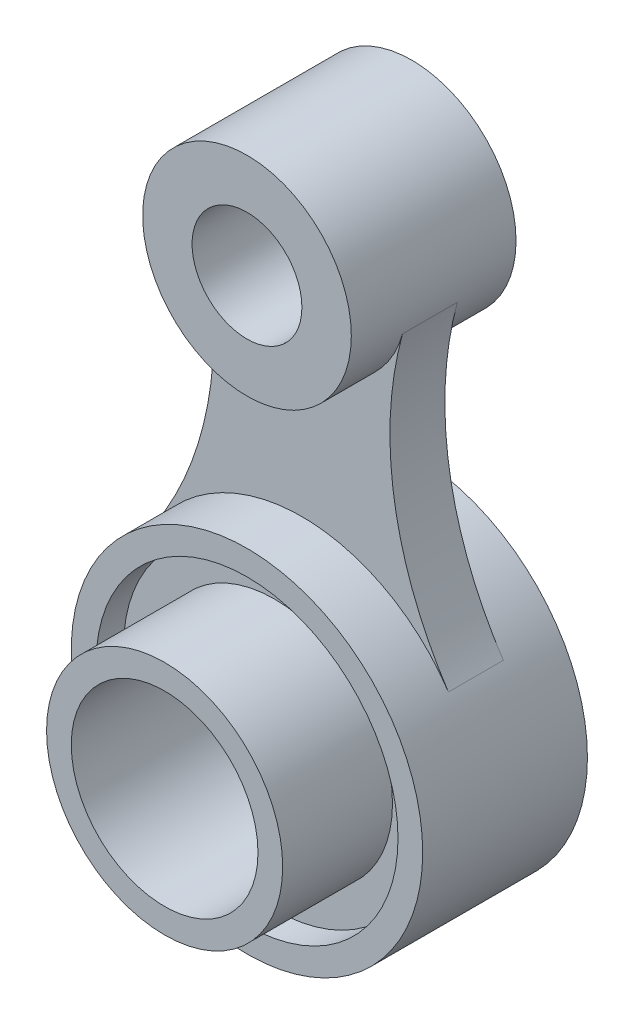
ISO-10303-21;
HEADER;
FILE_DESCRIPTION(('STEP AP214'),'2;1');
FILE_NAME('part.step','',(''),(''),'','','');
FILE_SCHEMA(('AUTOMOTIVE_DESIGN { 1 0 10303 214 1 1 1 1 }'));
ENDSEC;
DATA;
#1=APPLICATION_CONTEXT('core data for automotive mechanical design processes');
#2=APPLICATION_PROTOCOL_DEFINITION('international standard','automotive_design',2000,#1);
#3=PRODUCT_CONTEXT('',#1,'mechanical');
#4=PRODUCT('Part','Part','',(#3));
#5=PRODUCT_RELATED_PRODUCT_CATEGORY('part','',(#4));
#6=PRODUCT_DEFINITION_FORMATION('','',#4);
#7=PRODUCT_DEFINITION_CONTEXT('part definition',#1,'design');
#8=PRODUCT_DEFINITION('design','',#6,#7);
#9=PRODUCT_DEFINITION_SHAPE('','',#8);
#10=(LENGTH_UNIT() NAMED_UNIT(*) SI_UNIT(.MILLI.,.METRE.));
#11=(NAMED_UNIT(*) PLANE_ANGLE_UNIT() SI_UNIT($,.RADIAN.));
#12=(NAMED_UNIT(*) SI_UNIT($,.STERADIAN.) SOLID_ANGLE_UNIT());
#13=UNCERTAINTY_MEASURE_WITH_UNIT(LENGTH_MEASURE(1.E-05),#10,'distance_accuracy_value','');
#14=(GEOMETRIC_REPRESENTATION_CONTEXT(3) GLOBAL_UNCERTAINTY_ASSIGNED_CONTEXT((#13)) GLOBAL_UNIT_ASSIGNED_CONTEXT((#10,
#11,#12)) REPRESENTATION_CONTEXT('',''));
#15=CARTESIAN_POINT('',(0.,0.,0.));
#16=DIRECTION('',(0.,0.,1.));
#17=DIRECTION('',(1.,0.,0.));
#18=AXIS2_PLACEMENT_3D('',#15,#16,#17);
#19=CARTESIAN_POINT('',(0.,75.,30.));
#20=DIRECTION('',(0.,0.,-1.));
#21=DIRECTION('',(-1.,0.,0.));
#22=AXIS2_PLACEMENT_3D('',#19,#20,#21);
#23=CYLINDRICAL_SURFACE('',#22,19.);
#24=DIRECTION('',(0.,0.,-1.));
#25=VECTOR('',#24,1.);
#26=CARTESIAN_POINT('',(-18.3212439861572,69.9669076305221,20.));
#27=LINE('',#26,#25);
#28=CARTESIAN_POINT('',(-18.3212439861572,69.9669076305221,20.));
#29=VERTEX_POINT('',#28);
#30=CARTESIAN_POINT('',(-18.3212439861572,69.9669076305221,10.));
#31=VERTEX_POINT('',#30);
#32=EDGE_CURVE('E57',#29,#31,#27,.T.);
#33=ORIENTED_EDGE('',*,*,#32,.F.);
#34=CARTESIAN_POINT('',(0.,75.,20.));
#35=DIRECTION('',(0.,0.,1.));
#36=DIRECTION('',(1.,0.,0.));
#37=AXIS2_PLACEMENT_3D('',#34,#35,#36);
#38=CIRCLE('',#37,19.);
#39=CARTESIAN_POINT('',(18.3212439861573,69.9669076305221,20.));
#40=VERTEX_POINT('',#39);
#41=EDGE_CURVE('E62',#29,#40,#38,.T.);
#42=ORIENTED_EDGE('',*,*,#41,.T.);
#43=DIRECTION('',(0.,0.,-1.));
#44=VECTOR('',#43,1.);
#45=CARTESIAN_POINT('',(18.3212439861572,69.9669076305221,20.));
#46=LINE('',#45,#44);
#47=CARTESIAN_POINT('',(18.3212439861572,69.9669076305221,10.));
#48=VERTEX_POINT('',#47);
#49=EDGE_CURVE('E102',#40,#48,#46,.T.);
#50=ORIENTED_EDGE('',*,*,#49,.T.);
#51=CARTESIAN_POINT('',(0.,75.,10.));
#52=DIRECTION('',(0.,0.,1.));
#53=DIRECTION('',(1.,0.,0.));
#54=AXIS2_PLACEMENT_3D('',#51,#52,#53);
#55=CIRCLE('',#54,19.);
#56=EDGE_CURVE('E106',#31,#48,#55,.T.);
#57=ORIENTED_EDGE('',*,*,#56,.F.);
#58=EDGE_LOOP('',(#33,#42,#50,#57));
#59=FACE_BOUND('',#58,.T.);
#60=CARTESIAN_POINT('',(0.,75.,30.));
#61=DIRECTION('',(0.,0.,1.));
#62=DIRECTION('',(1.,0.,0.));
#63=AXIS2_PLACEMENT_3D('',#60,#61,#62);
#64=CIRCLE('',#63,19.);
#65=CARTESIAN_POINT('',(19.,75.,30.));
#66=VERTEX_POINT('',#65);
#67=EDGE_CURVE('E49',#66,#66,#64,.T.);
#68=ORIENTED_EDGE('',*,*,#67,.F.);
#69=EDGE_LOOP('',(#68));
#70=FACE_BOUND('',#69,.T.);
#71=CARTESIAN_POINT('',(0.,75.,0.));
#72=DIRECTION('',(0.,0.,1.));
#73=DIRECTION('',(1.,0.,0.));
#74=AXIS2_PLACEMENT_3D('',#71,#72,#73);
#75=CIRCLE('',#74,19.);
#76=CARTESIAN_POINT('',(19.,75.,0.));
#77=VERTEX_POINT('',#76);
#78=EDGE_CURVE('E115',#77,#77,#75,.T.);
#79=ORIENTED_EDGE('',*,*,#78,.T.);
#80=EDGE_LOOP('',(#79));
#81=FACE_BOUND('',#80,.T.);
#82=ADVANCED_FACE('F41',(#59,#70,#81),#23,.T.);
#83=CARTESIAN_POINT('',(0.,75.,30.));
#84=DIRECTION('',(0.,0.,-1.));
#85=DIRECTION('',(-1.,0.,0.));
#86=AXIS2_PLACEMENT_3D('',#83,#84,#85);
#87=CYLINDRICAL_SURFACE('',#86,10.);
#88=CARTESIAN_POINT('',(0.,75.,30.));
#89=DIRECTION('',(0.,0.,1.));
#90=DIRECTION('',(1.,0.,0.));
#91=AXIS2_PLACEMENT_3D('',#88,#89,#90);
#92=CIRCLE('',#91,10.);
#93=CARTESIAN_POINT('',(10.,75.,30.));
#94=VERTEX_POINT('',#93);
#95=EDGE_CURVE('E11',#94,#94,#92,.T.);
#96=ORIENTED_EDGE('',*,*,#95,.T.);
#97=EDGE_LOOP('',(#96));
#98=FACE_BOUND('',#97,.T.);
#99=CARTESIAN_POINT('',(0.,75.,0.));
#100=DIRECTION('',(0.,0.,1.));
#101=DIRECTION('',(1.,0.,0.));
#102=AXIS2_PLACEMENT_3D('',#99,#100,#101);
#103=CIRCLE('',#102,10.);
#104=CARTESIAN_POINT('',(10.,75.,0.));
#105=VERTEX_POINT('',#104);
#106=EDGE_CURVE('E44',#105,#105,#103,.T.);
#107=ORIENTED_EDGE('',*,*,#106,.F.);
#108=EDGE_LOOP('',(#107));
#109=FACE_BOUND('',#108,.T.);
#110=ADVANCED_FACE('F125',(#98,#109),#87,.F.);
#111=CARTESIAN_POINT('',(0.,0.,30.));
#112=DIRECTION('',(0.,0.,1.));
#113=DIRECTION('',(1.,0.,0.));
#114=AXIS2_PLACEMENT_3D('',#111,#112,#113);
#115=PLANE('',#114);
#116=ORIENTED_EDGE('',*,*,#67,.T.);
#117=EDGE_LOOP('',(#116));
#118=FACE_BOUND('',#117,.T.);
#119=ORIENTED_EDGE('',*,*,#95,.F.);
#120=EDGE_LOOP('',(#119));
#121=FACE_BOUND('',#120,.T.);
#122=ADVANCED_FACE('F127',(#118,#121),#115,.T.);
#123=CARTESIAN_POINT('',(0.,0.,0.));
#124=DIRECTION('',(0.,0.,1.));
#125=DIRECTION('',(1.,0.,0.));
#126=AXIS2_PLACEMENT_3D('',#123,#124,#125);
#127=PLANE('',#126);
#128=ORIENTED_EDGE('',*,*,#78,.F.);
#129=EDGE_LOOP('',(#128));
#130=FACE_BOUND('',#129,.T.);
#131=ORIENTED_EDGE('',*,*,#106,.T.);
#132=EDGE_LOOP('',(#131));
#133=FACE_BOUND('',#132,.T.);
#134=ADVANCED_FACE('F123',(#130,#133),#127,.F.);
#135=CARTESIAN_POINT('',(-80.034907939529,53.0133333333333,20.));
#136=DIRECTION('',(0.,0.,-1.));
#137=DIRECTION('',(-1.,0.,0.));
#138=AXIS2_PLACEMENT_3D('',#135,#136,#137);
#139=CYLINDRICAL_SURFACE('',#138,64.);
#140=CARTESIAN_POINT('',(-80.034907939529,53.0133333333333,10.));
#141=DIRECTION('',(0.,0.,1.));
#142=DIRECTION('',(1.,0.,0.));
#143=AXIS2_PLACEMENT_3D('',#140,#141,#142);
#144=CIRCLE('',#143,64.);
#145=CARTESIAN_POINT('',(-26.6783026465097,17.6711111111111,10.));
#146=VERTEX_POINT('',#145);
#147=EDGE_CURVE('E94',#31,#146,#144,.F.);
#148=ORIENTED_EDGE('',*,*,#147,.T.);
#149=DIRECTION('',(0.,0.,-1.));
#150=VECTOR('',#149,1.);
#151=CARTESIAN_POINT('',(-26.6783026465097,17.6711111111111,20.));
#152=LINE('',#151,#150);
#153=CARTESIAN_POINT('',(-26.6783026465097,17.6711111111111,20.));
#154=VERTEX_POINT('',#153);
#155=EDGE_CURVE('E88',#154,#146,#152,.T.);
#156=ORIENTED_EDGE('',*,*,#155,.F.);
#157=CARTESIAN_POINT('',(-80.034907939529,53.0133333333333,20.));
#158=DIRECTION('',(0.,0.,1.));
#159=DIRECTION('',(1.,0.,0.));
#160=AXIS2_PLACEMENT_3D('',#157,#158,#159);
#161=CIRCLE('',#160,64.);
#162=EDGE_CURVE('E108',#29,#154,#161,.F.);
#163=ORIENTED_EDGE('',*,*,#162,.F.);
#164=ORIENTED_EDGE('',*,*,#32,.T.);
#165=EDGE_LOOP('',(#148,#156,#163,#164));
#166=FACE_BOUND('',#165,.T.);
#167=ADVANCED_FACE('F137',(#166),#139,.F.);
#168=CARTESIAN_POINT('',(80.034907939529,53.0133333333333,20.));
#169=DIRECTION('',(0.,0.,-1.));
#170=DIRECTION('',(-1.,0.,0.));
#171=AXIS2_PLACEMENT_3D('',#168,#169,#170);
#172=CYLINDRICAL_SURFACE('',#171,64.);
#173=CARTESIAN_POINT('',(80.034907939529,53.0133333333333,10.));
#174=DIRECTION('',(0.,0.,1.));
#175=DIRECTION('',(1.,0.,0.));
#176=AXIS2_PLACEMENT_3D('',#173,#174,#175);
#177=CIRCLE('',#176,64.);
#178=CARTESIAN_POINT('',(26.6783026465097,17.6711111111111,10.));
#179=VERTEX_POINT('',#178);
#180=EDGE_CURVE('E93',#48,#179,#177,.T.);
#181=ORIENTED_EDGE('',*,*,#180,.F.);
#182=ORIENTED_EDGE('',*,*,#49,.F.);
#183=CARTESIAN_POINT('',(80.034907939529,53.0133333333333,20.));
#184=DIRECTION('',(0.,0.,1.));
#185=DIRECTION('',(1.,0.,0.));
#186=AXIS2_PLACEMENT_3D('',#183,#184,#185);
#187=CIRCLE('',#186,64.);
#188=CARTESIAN_POINT('',(26.6783026465097,17.6711111111111,20.));
#189=VERTEX_POINT('',#188);
#190=EDGE_CURVE('E101',#40,#189,#187,.T.);
#191=ORIENTED_EDGE('',*,*,#190,.T.);
#192=DIRECTION('',(0.,0.,-1.));
#193=VECTOR('',#192,1.);
#194=CARTESIAN_POINT('',(26.6783026465097,17.6711111111111,20.));
#195=LINE('',#194,#193);
#196=EDGE_CURVE('E85',#189,#179,#195,.T.);
#197=ORIENTED_EDGE('',*,*,#196,.T.);
#198=EDGE_LOOP('',(#181,#182,#191,#197));
#199=FACE_BOUND('',#198,.T.);
#200=ADVANCED_FACE('F99',(#199),#172,.F.);
#201=CARTESIAN_POINT('',(0.,0.,20.));
#202=DIRECTION('',(0.,0.,1.));
#203=DIRECTION('',(1.,0.,0.));
#204=AXIS2_PLACEMENT_3D('',#201,#202,#203);
#205=PLANE('',#204);
#206=ORIENTED_EDGE('',*,*,#41,.F.);
#207=ORIENTED_EDGE('',*,*,#162,.T.);
#208=CARTESIAN_POINT('',(0.,0.,20.));
#209=DIRECTION('',(0.,0.,1.));
#210=DIRECTION('',(1.,0.,0.));
#211=AXIS2_PLACEMENT_3D('',#208,#209,#210);
#212=CIRCLE('',#211,32.);
#213=EDGE_CURVE('E213',#189,#154,#212,.T.);
#214=ORIENTED_EDGE('',*,*,#213,.F.);
#215=ORIENTED_EDGE('',*,*,#190,.F.);
#216=EDGE_LOOP('',(#206,#207,#214,#215));
#217=FACE_BOUND('',#216,.T.);
#218=ADVANCED_FACE('F145',(#217),#205,.T.);
#219=CARTESIAN_POINT('',(0.,0.,10.));
#220=DIRECTION('',(0.,0.,1.));
#221=DIRECTION('',(1.,0.,0.));
#222=AXIS2_PLACEMENT_3D('',#219,#220,#221);
#223=PLANE('',#222);
#224=ORIENTED_EDGE('',*,*,#56,.T.);
#225=ORIENTED_EDGE('',*,*,#180,.T.);
#226=CARTESIAN_POINT('',(0.,0.,10.));
#227=DIRECTION('',(0.,0.,1.));
#228=DIRECTION('',(1.,0.,0.));
#229=AXIS2_PLACEMENT_3D('',#226,#227,#228);
#230=CIRCLE('',#229,32.);
#231=EDGE_CURVE('E81',#179,#146,#230,.T.);
#232=ORIENTED_EDGE('',*,*,#231,.T.);
#233=ORIENTED_EDGE('',*,*,#147,.F.);
#234=EDGE_LOOP('',(#224,#225,#232,#233));
#235=FACE_BOUND('',#234,.T.);
#236=ADVANCED_FACE('F105',(#235),#223,.F.);
#237=CARTESIAN_POINT('',(0.,0.,30.));
#238=DIRECTION('',(0.,0.,-1.));
#239=DIRECTION('',(-1.,0.,0.));
#240=AXIS2_PLACEMENT_3D('',#237,#238,#239);
#241=CYLINDRICAL_SURFACE('',#240,27.5);
#242=CARTESIAN_POINT('',(0.,0.,25.));
#243=DIRECTION('',(0.,0.,1.));
#244=DIRECTION('',(1.,0.,0.));
#245=AXIS2_PLACEMENT_3D('',#242,#243,#244);
#246=CIRCLE('',#245,27.5);
#247=CARTESIAN_POINT('',(27.5,0.,25.));
#248=VERTEX_POINT('',#247);
#249=EDGE_CURVE('E206',#248,#248,#246,.T.);
#250=ORIENTED_EDGE('',*,*,#249,.F.);
#251=EDGE_LOOP('',(#250));
#252=FACE_BOUND('',#251,.T.);
#253=CARTESIAN_POINT('',(0.,0.,30.));
#254=DIRECTION('',(0.,0.,1.));
#255=DIRECTION('',(1.,0.,0.));
#256=AXIS2_PLACEMENT_3D('',#253,#254,#255);
#257=CIRCLE('',#256,27.5);
#258=CARTESIAN_POINT('',(27.5,0.,30.));
#259=VERTEX_POINT('',#258);
#260=EDGE_CURVE('E200',#259,#259,#257,.T.);
#261=ORIENTED_EDGE('',*,*,#260,.T.);
#262=EDGE_LOOP('',(#261));
#263=FACE_BOUND('',#262,.T.);
#264=ADVANCED_FACE('F148',(#252,#263),#241,.F.);
#265=CARTESIAN_POINT('',(0.,0.,30.));
#266=DIRECTION('',(0.,0.,-1.));
#267=DIRECTION('',(-1.,0.,0.));
#268=AXIS2_PLACEMENT_3D('',#265,#266,#267);
#269=CYLINDRICAL_SURFACE('',#268,32.);
#270=ORIENTED_EDGE('',*,*,#213,.T.);
#271=ORIENTED_EDGE('',*,*,#155,.T.);
#272=ORIENTED_EDGE('',*,*,#231,.F.);
#273=ORIENTED_EDGE('',*,*,#196,.F.);
#274=EDGE_LOOP('',(#270,#271,#272,#273));
#275=FACE_BOUND('',#274,.T.);
#276=CARTESIAN_POINT('',(0.,0.,30.));
#277=DIRECTION('',(0.,0.,1.));
#278=DIRECTION('',(1.,0.,0.));
#279=AXIS2_PLACEMENT_3D('',#276,#277,#278);
#280=CIRCLE('',#279,32.);
#281=CARTESIAN_POINT('',(32.,0.,30.));
#282=VERTEX_POINT('',#281);
#283=EDGE_CURVE('E203',#282,#282,#280,.T.);
#284=ORIENTED_EDGE('',*,*,#283,.F.);
#285=EDGE_LOOP('',(#284));
#286=FACE_BOUND('',#285,.T.);
#287=CARTESIAN_POINT('',(0.,0.,0.));
#288=DIRECTION('',(0.,0.,1.));
#289=DIRECTION('',(1.,0.,0.));
#290=AXIS2_PLACEMENT_3D('',#287,#288,#289);
#291=CIRCLE('',#290,32.);
#292=CARTESIAN_POINT('',(32.,0.,0.));
#293=VERTEX_POINT('',#292);
#294=EDGE_CURVE('E193',#293,#293,#291,.T.);
#295=ORIENTED_EDGE('',*,*,#294,.T.);
#296=EDGE_LOOP('',(#295));
#297=FACE_BOUND('',#296,.T.);
#298=ADVANCED_FACE('F83',(#275,#286,#297),#269,.T.);
#299=CARTESIAN_POINT('',(0.,0.,30.));
#300=DIRECTION('',(0.,0.,1.));
#301=DIRECTION('',(1.,0.,0.));
#302=AXIS2_PLACEMENT_3D('',#299,#300,#301);
#303=PLANE('',#302);
#304=ORIENTED_EDGE('',*,*,#260,.F.);
#305=EDGE_LOOP('',(#304));
#306=FACE_BOUND('',#305,.T.);
#307=ORIENTED_EDGE('',*,*,#283,.T.);
#308=EDGE_LOOP('',(#307));
#309=FACE_BOUND('',#308,.T.);
#310=ADVANCED_FACE('F157',(#306,#309),#303,.T.);
#311=CARTESIAN_POINT('',(0.,0.,0.));
#312=DIRECTION('',(0.,0.,1.));
#313=DIRECTION('',(1.,0.,0.));
#314=AXIS2_PLACEMENT_3D('',#311,#312,#313);
#315=PLANE('',#314);
#316=ORIENTED_EDGE('',*,*,#294,.F.);
#317=EDGE_LOOP('',(#316));
#318=FACE_BOUND('',#317,.T.);
#319=CARTESIAN_POINT('',(0.,0.,0.));
#320=DIRECTION('',(0.,0.,1.));
#321=DIRECTION('',(1.,0.,0.));
#322=AXIS2_PLACEMENT_3D('',#319,#320,#321);
#323=CIRCLE('',#322,17.);
#324=CARTESIAN_POINT('',(-17.,0.,0.));
#325=VERTEX_POINT('',#324);
#326=EDGE_CURVE('E195',#325,#325,#323,.T.);
#327=ORIENTED_EDGE('',*,*,#326,.T.);
#328=EDGE_LOOP('',(#327));
#329=FACE_BOUND('',#328,.T.);
#330=ADVANCED_FACE('F158',(#318,#329),#315,.F.);
#331=CARTESIAN_POINT('',(0.,0.,25.));
#332=DIRECTION('',(0.,0.,1.));
#333=DIRECTION('',(1.,0.,0.));
#334=AXIS2_PLACEMENT_3D('',#331,#332,#333);
#335=PLANE('',#334);
#336=CARTESIAN_POINT('',(0.,0.,25.));
#337=DIRECTION('',(0.,0.,1.));
#338=DIRECTION('',(1.,0.,0.));
#339=AXIS2_PLACEMENT_3D('',#336,#337,#338);
#340=CIRCLE('',#339,21.5);
#341=CARTESIAN_POINT('',(-21.5,0.,25.));
#342=VERTEX_POINT('',#341);
#343=EDGE_CURVE('E190',#342,#342,#340,.T.);
#344=ORIENTED_EDGE('',*,*,#343,.F.);
#345=EDGE_LOOP('',(#344));
#346=FACE_BOUND('',#345,.T.);
#347=ORIENTED_EDGE('',*,*,#249,.T.);
#348=EDGE_LOOP('',(#347));
#349=FACE_BOUND('',#348,.T.);
#350=ADVANCED_FACE('F161',(#346,#349),#335,.T.);
#351=CARTESIAN_POINT('',(0.,0.,45.));
#352=DIRECTION('',(0.,0.,-1.));
#353=DIRECTION('',(-1.,0.,0.));
#354=AXIS2_PLACEMENT_3D('',#351,#352,#353);
#355=CYLINDRICAL_SURFACE('',#354,17.);
#356=CARTESIAN_POINT('',(0.,0.,45.));
#357=DIRECTION('',(0.,0.,1.));
#358=DIRECTION('',(1.,0.,0.));
#359=AXIS2_PLACEMENT_3D('',#356,#357,#358);
#360=CIRCLE('',#359,17.);
#361=CARTESIAN_POINT('',(-17.,0.,45.));
#362=VERTEX_POINT('',#361);
#363=EDGE_CURVE('E185',#362,#362,#360,.T.);
#364=CARTESIAN_POINT('',(-17.,0.,45.));
#365=CARTESIAN_POINT('',(-17.,0.,44.53125));
#366=CARTESIAN_POINT('',(-17.,0.,44.0625));
#367=CARTESIAN_POINT('',(-17.,0.,43.125));
#368=CARTESIAN_POINT('',(-17.,0.,42.65625));
#369=CARTESIAN_POINT('',(-17.,0.,41.71875));
#370=CARTESIAN_POINT('',(-17.,0.,41.25));
#371=CARTESIAN_POINT('',(-17.,0.,40.3125));
#372=CARTESIAN_POINT('',(-17.,0.,39.84375));
#373=CARTESIAN_POINT('',(-17.,0.,38.90625));
#374=CARTESIAN_POINT('',(-17.,0.,38.4375));
#375=CARTESIAN_POINT('',(-17.,0.,37.5));
#376=CARTESIAN_POINT('',(-17.,0.,37.03125));
#377=CARTESIAN_POINT('',(-17.,0.,36.09375));
#378=CARTESIAN_POINT('',(-17.,0.,35.625));
#379=CARTESIAN_POINT('',(-17.,0.,34.6875));
#380=CARTESIAN_POINT('',(-17.,0.,34.21875));
#381=CARTESIAN_POINT('',(-17.,0.,33.28125));
#382=CARTESIAN_POINT('',(-17.,0.,32.8125));
#383=CARTESIAN_POINT('',(-17.,0.,31.875));
#384=CARTESIAN_POINT('',(-17.,0.,31.40625));
#385=CARTESIAN_POINT('',(-17.,0.,30.46875));
#386=CARTESIAN_POINT('',(-17.,0.,30.));
#387=CARTESIAN_POINT('',(-17.,0.,29.0625));
#388=CARTESIAN_POINT('',(-17.,0.,28.59375));
#389=CARTESIAN_POINT('',(-17.,0.,27.65625));
#390=CARTESIAN_POINT('',(-17.,0.,27.1875));
#391=CARTESIAN_POINT('',(-17.,0.,26.25));
#392=CARTESIAN_POINT('',(-17.,0.,25.78125));
#393=CARTESIAN_POINT('',(-17.,0.,24.84375));
#394=CARTESIAN_POINT('',(-17.,0.,24.375));
#395=CARTESIAN_POINT('',(-17.,0.,23.4375));
#396=CARTESIAN_POINT('',(-17.,0.,22.96875));
#397=CARTESIAN_POINT('',(-17.,0.,22.03125));
#398=CARTESIAN_POINT('',(-17.,0.,21.5625));
#399=CARTESIAN_POINT('',(-17.,0.,20.625));
#400=CARTESIAN_POINT('',(-17.,0.,20.15625));
#401=CARTESIAN_POINT('',(-17.,0.,19.21875));
#402=CARTESIAN_POINT('',(-17.,0.,18.75));
#403=CARTESIAN_POINT('',(-17.,0.,17.8125));
#404=CARTESIAN_POINT('',(-17.,0.,17.34375));
#405=CARTESIAN_POINT('',(-17.,0.,16.40625));
#406=CARTESIAN_POINT('',(-17.,0.,15.9375));
#407=CARTESIAN_POINT('',(-17.,0.,15.));
#408=CARTESIAN_POINT('',(-17.,0.,14.53125));
#409=CARTESIAN_POINT('',(-17.,0.,13.59375));
#410=CARTESIAN_POINT('',(-17.,0.,13.125));
#411=CARTESIAN_POINT('',(-17.,0.,12.1875));
#412=CARTESIAN_POINT('',(-17.,0.,11.71875));
#413=CARTESIAN_POINT('',(-17.,0.,10.78125));
#414=CARTESIAN_POINT('',(-17.,0.,10.3125));
#415=CARTESIAN_POINT('',(-17.,0.,9.375));
#416=CARTESIAN_POINT('',(-17.,0.,8.90625));
#417=CARTESIAN_POINT('',(-17.,0.,7.96875));
#418=CARTESIAN_POINT('',(-17.,0.,7.5));
#419=CARTESIAN_POINT('',(-17.,0.,6.5625));
#420=CARTESIAN_POINT('',(-17.,0.,6.09375));
#421=CARTESIAN_POINT('',(-17.,0.,5.15625));
#422=CARTESIAN_POINT('',(-17.,0.,4.6875));
#423=CARTESIAN_POINT('',(-17.,0.,3.75));
#424=CARTESIAN_POINT('',(-17.,0.,3.28125));
#425=CARTESIAN_POINT('',(-17.,0.,2.34375));
#426=CARTESIAN_POINT('',(-17.,0.,1.875));
#427=CARTESIAN_POINT('',(-17.,0.,0.937499999999999));
#428=CARTESIAN_POINT('',(-17.,0.,0.46875));
#429=CARTESIAN_POINT('',(-17.,0.,0.));
#430=B_SPLINE_CURVE_WITH_KNOTS('',3,(#364,#365,#366,#367,#368,#369,#370,#371,#372,#373,#374,
#375,#376,#377,#378,#379,#380,#381,#382,#383,#384,#385,#386,#387,#388,#389,#390,#391,#392,#393,
#394,#395,#396,#397,#398,#399,#400,#401,#402,#403,#404,#405,#406,#407,#408,#409,#410,#411,#412,
#413,#414,#415,#416,#417,#418,#419,#420,#421,#422,#423,#424,#425,#426,#427,#428,#429),
.UNSPECIFIED.,.F.,.F.,(4,2,2,2,2,2,2,2,2,2,2,2,2,2,2,2,2,2,2,2,2,2,2,2,2,2,2,2,2,2,2,2,4),(0.,
1.40625,2.8125,4.21874999999999,5.625,7.03125,8.43749999999999,9.84375,11.25,12.65625,14.0625,
15.46875,16.875,18.28125,19.6875,21.09375,22.5,23.90625,25.3125,26.71875,28.125,29.53125,
30.9375,32.34375,33.75,35.15625,36.5625,37.96875,39.375,40.78125,42.1875,43.59375,45.),.UNSPECIFIED.);
#431=EDGE_CURVE('BSEAM168',#362,#325,#430,.T.);
#432=ORIENTED_EDGE('',*,*,#363,.T.);
#433=ORIENTED_EDGE('',*,*,#326,.F.);
#434=ORIENTED_EDGE('',*,*,#431,.T.);
#435=ORIENTED_EDGE('',*,*,#431,.F.);
#436=EDGE_LOOP('',(#432,#434,#433,#435));
#437=FACE_BOUND('',#436,.T.);
#438=ADVANCED_FACE('F168',(#437),#355,.F.);
#439=CARTESIAN_POINT('',(0.,0.,45.));
#440=DIRECTION('',(0.,0.,-1.));
#441=DIRECTION('',(-1.,0.,0.));
#442=AXIS2_PLACEMENT_3D('',#439,#440,#441);
#443=CYLINDRICAL_SURFACE('',#442,21.5);
#444=CARTESIAN_POINT('',(0.,0.,45.));
#445=DIRECTION('',(0.,0.,1.));
#446=DIRECTION('',(1.,0.,0.));
#447=AXIS2_PLACEMENT_3D('',#444,#445,#446);
#448=CIRCLE('',#447,21.5);
#449=CARTESIAN_POINT('',(-21.5,0.,45.));
#450=VERTEX_POINT('',#449);
#451=EDGE_CURVE('E188',#450,#450,#448,.T.);
#452=CARTESIAN_POINT('',(-21.5,0.,25.));
#453=CARTESIAN_POINT('',(-21.5,0.,25.2083333333333));
#454=CARTESIAN_POINT('',(-21.5,0.,25.4166666666667));
#455=CARTESIAN_POINT('',(-21.5,0.,25.8333333333333));
#456=CARTESIAN_POINT('',(-21.5,0.,26.0416666666667));
#457=CARTESIAN_POINT('',(-21.5,0.,26.4583333333333));
#458=CARTESIAN_POINT('',(-21.5,0.,26.6666666666667));
#459=CARTESIAN_POINT('',(-21.5,0.,27.0833333333333));
#460=CARTESIAN_POINT('',(-21.5,0.,27.2916666666667));
#461=CARTESIAN_POINT('',(-21.5,0.,27.7083333333333));
#462=CARTESIAN_POINT('',(-21.5,0.,27.9166666666667));
#463=CARTESIAN_POINT('',(-21.5,0.,28.3333333333333));
#464=CARTESIAN_POINT('',(-21.5,0.,28.5416666666667));
#465=CARTESIAN_POINT('',(-21.5,0.,28.9583333333333));
#466=CARTESIAN_POINT('',(-21.5,0.,29.1666666666667));
#467=CARTESIAN_POINT('',(-21.5,0.,29.5833333333333));
#468=CARTESIAN_POINT('',(-21.5,0.,29.7916666666667));
#469=CARTESIAN_POINT('',(-21.5,0.,30.2083333333333));
#470=CARTESIAN_POINT('',(-21.5,0.,30.4166666666667));
#471=CARTESIAN_POINT('',(-21.5,0.,30.8333333333333));
#472=CARTESIAN_POINT('',(-21.5,0.,31.0416666666667));
#473=CARTESIAN_POINT('',(-21.5,0.,31.4583333333333));
#474=CARTESIAN_POINT('',(-21.5,0.,31.6666666666667));
#475=CARTESIAN_POINT('',(-21.5,0.,32.0833333333333));
#476=CARTESIAN_POINT('',(-21.5,0.,32.2916666666667));
#477=CARTESIAN_POINT('',(-21.5,0.,32.7083333333333));
#478=CARTESIAN_POINT('',(-21.5,0.,32.9166666666667));
#479=CARTESIAN_POINT('',(-21.5,0.,33.3333333333333));
#480=CARTESIAN_POINT('',(-21.5,0.,33.5416666666667));
#481=CARTESIAN_POINT('',(-21.5,0.,33.9583333333333));
#482=CARTESIAN_POINT('',(-21.5,0.,34.1666666666667));
#483=CARTESIAN_POINT('',(-21.5,0.,34.5833333333333));
#484=CARTESIAN_POINT('',(-21.5,0.,34.7916666666667));
#485=CARTESIAN_POINT('',(-21.5,0.,35.2083333333333));
#486=CARTESIAN_POINT('',(-21.5,0.,35.4166666666667));
#487=CARTESIAN_POINT('',(-21.5,0.,35.8333333333333));
#488=CARTESIAN_POINT('',(-21.5,0.,36.0416666666667));
#489=CARTESIAN_POINT('',(-21.5,0.,36.4583333333333));
#490=CARTESIAN_POINT('',(-21.5,0.,36.6666666666667));
#491=CARTESIAN_POINT('',(-21.5,0.,37.0833333333333));
#492=CARTESIAN_POINT('',(-21.5,0.,37.2916666666667));
#493=CARTESIAN_POINT('',(-21.5,0.,37.7083333333333));
#494=CARTESIAN_POINT('',(-21.5,0.,37.9166666666667));
#495=CARTESIAN_POINT('',(-21.5,0.,38.3333333333333));
#496=CARTESIAN_POINT('',(-21.5,0.,38.5416666666667));
#497=CARTESIAN_POINT('',(-21.5,0.,38.9583333333333));
#498=CARTESIAN_POINT('',(-21.5,0.,39.1666666666667));
#499=CARTESIAN_POINT('',(-21.5,0.,39.5833333333333));
#500=CARTESIAN_POINT('',(-21.5,0.,39.7916666666667));
#501=CARTESIAN_POINT('',(-21.5,0.,40.2083333333333));
#502=CARTESIAN_POINT('',(-21.5,0.,40.4166666666667));
#503=CARTESIAN_POINT('',(-21.5,0.,40.8333333333333));
#504=CARTESIAN_POINT('',(-21.5,0.,41.0416666666667));
#505=CARTESIAN_POINT('',(-21.5,0.,41.4583333333333));
#506=CARTESIAN_POINT('',(-21.5,0.,41.6666666666667));
#507=CARTESIAN_POINT('',(-21.5,0.,42.0833333333333));
#508=CARTESIAN_POINT('',(-21.5,0.,42.2916666666667));
#509=CARTESIAN_POINT('',(-21.5,0.,42.7083333333333));
#510=CARTESIAN_POINT('',(-21.5,0.,42.9166666666667));
#511=CARTESIAN_POINT('',(-21.5,0.,43.3333333333333));
#512=CARTESIAN_POINT('',(-21.5,0.,43.5416666666667));
#513=CARTESIAN_POINT('',(-21.5,0.,43.9583333333333));
#514=CARTESIAN_POINT('',(-21.5,0.,44.1666666666667));
#515=CARTESIAN_POINT('',(-21.5,0.,44.5833333333333));
#516=CARTESIAN_POINT('',(-21.5,0.,44.7916666666667));
#517=CARTESIAN_POINT('',(-21.5,0.,45.));
#518=B_SPLINE_CURVE_WITH_KNOTS('',3,(#452,#453,#454,#455,#456,#457,#458,#459,#460,#461,#462,
#463,#464,#465,#466,#467,#468,#469,#470,#471,#472,#473,#474,#475,#476,#477,#478,#479,#480,#481,
#482,#483,#484,#485,#486,#487,#488,#489,#490,#491,#492,#493,#494,#495,#496,#497,#498,#499,#500,
#501,#502,#503,#504,#505,#506,#507,#508,#509,#510,#511,#512,#513,#514,#515,#516,#517),
.UNSPECIFIED.,.F.,.F.,(4,2,2,2,2,2,2,2,2,2,2,2,2,2,2,2,2,2,2,2,2,2,2,2,2,2,2,2,2,2,2,2,4),(0.,
0.625000000000001,1.25,1.875,2.5,3.125,3.75,4.375,5.,5.625,6.25,6.875,7.5,8.125,8.75,
9.37500000000001,10.,10.625,11.25,11.875,12.5,13.125,13.75,14.375,15.,15.625,16.25,16.875,17.5,
18.125,18.75,19.375,20.),.UNSPECIFIED.);
#519=EDGE_CURVE('BSEAM172',#342,#450,#518,.T.);
#520=ORIENTED_EDGE('',*,*,#343,.T.);
#521=ORIENTED_EDGE('',*,*,#451,.F.);
#522=ORIENTED_EDGE('',*,*,#519,.T.);
#523=ORIENTED_EDGE('',*,*,#519,.F.);
#524=EDGE_LOOP('',(#520,#522,#521,#523));
#525=FACE_BOUND('',#524,.T.);
#526=ADVANCED_FACE('F172',(#525),#443,.T.);
#527=CARTESIAN_POINT('',(0.,0.,45.));
#528=DIRECTION('',(0.,0.,1.));
#529=DIRECTION('',(1.,0.,0.));
#530=AXIS2_PLACEMENT_3D('',#527,#528,#529);
#531=PLANE('',#530);
#532=ORIENTED_EDGE('',*,*,#363,.F.);
#533=EDGE_LOOP('',(#532));
#534=FACE_BOUND('',#533,.T.);
#535=ORIENTED_EDGE('',*,*,#451,.T.);
#536=EDGE_LOOP('',(#535));
#537=FACE_BOUND('',#536,.T.);
#538=ADVANCED_FACE('F176',(#534,#537),#531,.T.);
#539=CLOSED_SHELL('',(#82,#110,#122,#134,#167,#200,#218,#236,#264,#298,#310,#330,#350,#438,#526,#538));
#540=MANIFOLD_SOLID_BREP('B2',#539);
#541=ADVANCED_BREP_SHAPE_REPRESENTATION('',(#18,#540),#14);
#542=SHAPE_DEFINITION_REPRESENTATION(#9,#541);
ENDSEC;
END-ISO-10303-21;
